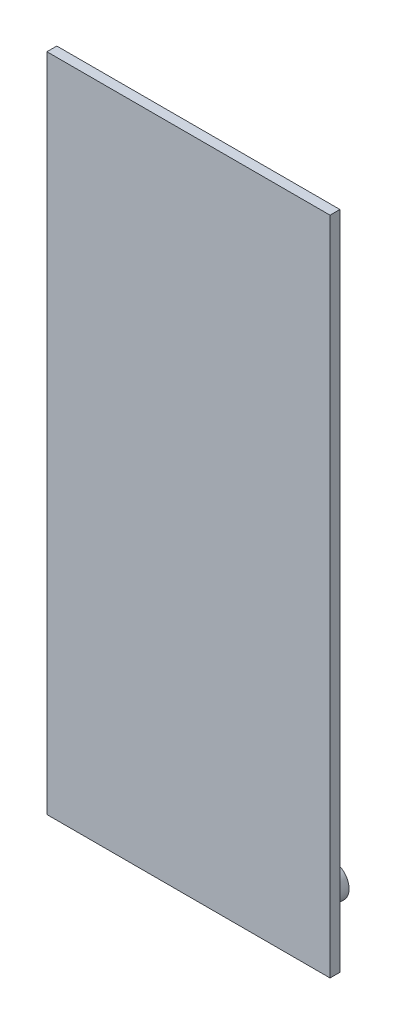
ISO-10303-21;
HEADER;
FILE_DESCRIPTION(('STEP AP214'),'2;1');
FILE_NAME('part.step','',(''),(''),'','','');
FILE_SCHEMA(('AUTOMOTIVE_DESIGN { 1 0 10303 214 1 1 1 1 }'));
ENDSEC;
DATA;
#1=APPLICATION_CONTEXT('core data for automotive mechanical design processes');
#2=APPLICATION_PROTOCOL_DEFINITION('international standard','automotive_design',2000,#1);
#3=PRODUCT_CONTEXT('',#1,'mechanical');
#4=PRODUCT('Part','Part','',(#3));
#5=PRODUCT_RELATED_PRODUCT_CATEGORY('part','',(#4));
#6=PRODUCT_DEFINITION_FORMATION('','',#4);
#7=PRODUCT_DEFINITION_CONTEXT('part definition',#1,'design');
#8=PRODUCT_DEFINITION('design','',#6,#7);
#9=PRODUCT_DEFINITION_SHAPE('','',#8);
#10=(LENGTH_UNIT() NAMED_UNIT(*) SI_UNIT(.MILLI.,.METRE.));
#11=(NAMED_UNIT(*) PLANE_ANGLE_UNIT() SI_UNIT($,.RADIAN.));
#12=(NAMED_UNIT(*) SI_UNIT($,.STERADIAN.) SOLID_ANGLE_UNIT());
#13=UNCERTAINTY_MEASURE_WITH_UNIT(LENGTH_MEASURE(1.E-05),#10,'distance_accuracy_value','');
#14=(GEOMETRIC_REPRESENTATION_CONTEXT(3) GLOBAL_UNCERTAINTY_ASSIGNED_CONTEXT((#13)) GLOBAL_UNIT_ASSIGNED_CONTEXT((#10,
#11,#12)) REPRESENTATION_CONTEXT('',''));
#15=CARTESIAN_POINT('',(0.,0.,0.));
#16=DIRECTION('',(0.,0.,1.));
#17=DIRECTION('',(1.,0.,0.));
#18=AXIS2_PLACEMENT_3D('',#15,#16,#17);
#19=CARTESIAN_POINT('',(55.4999992698431,53.,96.2149999552965));
#20=DIRECTION('',(0.,1.,0.));
#21=DIRECTION('',(1.,0.,0.));
#22=AXIS2_PLACEMENT_3D('',#19,#20,#21);
#23=PLANE('',#22);
#24=DIRECTION('',(1.,0.,0.));
#25=VECTOR('',#24,1.);
#26=CARTESIAN_POINT('',(32.9999992698431,53.,95.4299999552965));
#27=LINE('',#26,#25);
#28=CARTESIAN_POINT('',(32.9999992698431,53.,95.4299999552965));
#29=VERTEX_POINT('',#28);
#30=CARTESIAN_POINT('',(77.9999992698431,53.,95.4299999552965));
#31=VERTEX_POINT('',#30);
#32=EDGE_CURVE('E11',#29,#31,#27,.T.);
#33=ORIENTED_EDGE('',*,*,#32,.T.);
#34=DIRECTION('',(0.,0.,1.));
#35=VECTOR('',#34,1.);
#36=CARTESIAN_POINT('',(77.9999992698431,53.,95.4299999552965));
#37=LINE('',#36,#35);
#38=CARTESIAN_POINT('',(77.9999992698431,53.,96.9999999552965));
#39=VERTEX_POINT('',#38);
#40=EDGE_CURVE('E20',#31,#39,#37,.T.);
#41=ORIENTED_EDGE('',*,*,#40,.T.);
#42=DIRECTION('',(-1.,0.,0.));
#43=VECTOR('',#42,1.);
#44=CARTESIAN_POINT('',(77.9999992698431,53.,96.9999999552965));
#45=LINE('',#44,#43);
#46=CARTESIAN_POINT('',(32.9999992698431,53.,96.9999999552965));
#47=VERTEX_POINT('',#46);
#48=EDGE_CURVE('E95',#39,#47,#45,.T.);
#49=ORIENTED_EDGE('',*,*,#48,.T.);
#50=DIRECTION('',(0.,0.,-1.));
#51=VECTOR('',#50,1.);
#52=CARTESIAN_POINT('',(32.9999992698431,53.,96.9999999552965));
#53=LINE('',#52,#51);
#54=EDGE_CURVE('E130',#47,#29,#53,.T.);
#55=ORIENTED_EDGE('',*,*,#54,.T.);
#56=EDGE_LOOP('',(#33,#41,#49,#55));
#57=FACE_BOUND('',#56,.T.);
#58=ADVANCED_FACE('F17',(#57),#23,.F.);
#59=CARTESIAN_POINT('',(77.9999992698431,53.,95.4299999552965));
#60=DIRECTION('',(0.,0.,-1.));
#61=DIRECTION('',(0.,-1.,0.));
#62=AXIS2_PLACEMENT_3D('',#59,#60,#61);
#63=PLANE('',#62);
#64=CARTESIAN_POINT('',(73.0834949574164,61.5005702442213,95.4299999552965));
#65=DIRECTION('',(0.,0.,1.));
#66=DIRECTION('',(-1.,0.,0.));
#67=AXIS2_PLACEMENT_3D('',#64,#65,#66);
#68=CIRCLE('',#67,2.667);
#69=CARTESIAN_POINT('',(75.7504949574164,61.5005702442213,95.4299999552965));
#70=VERTEX_POINT('',#69);
#71=EDGE_CURVE('E121',#70,#70,#68,.T.);
#72=ORIENTED_EDGE('',*,*,#71,.T.);
#73=EDGE_LOOP('',(#72));
#74=FACE_BOUND('',#73,.T.);
#75=ORIENTED_EDGE('',*,*,#32,.F.);
#76=DIRECTION('',(0.,1.,0.));
#77=VECTOR('',#76,1.);
#78=CARTESIAN_POINT('',(32.9999992698431,53.,95.4299999552965));
#79=LINE('',#78,#77);
#80=CARTESIAN_POINT('',(32.9999992698431,158.,95.4299999552965));
#81=VERTEX_POINT('',#80);
#82=EDGE_CURVE('E27',#29,#81,#79,.T.);
#83=ORIENTED_EDGE('',*,*,#82,.T.);
#84=DIRECTION('',(-1.,0.,0.));
#85=VECTOR('',#84,1.);
#86=CARTESIAN_POINT('',(32.9999992698431,158.,95.4299999552965));
#87=LINE('',#86,#85);
#88=CARTESIAN_POINT('',(77.9999992698431,158.,95.4299999552965));
#89=VERTEX_POINT('',#88);
#90=EDGE_CURVE('E114',#89,#81,#87,.T.);
#91=ORIENTED_EDGE('',*,*,#90,.F.);
#92=DIRECTION('',(0.,1.,0.));
#93=VECTOR('',#92,1.);
#94=CARTESIAN_POINT('',(77.9999992698431,53.,95.4299999552965));
#95=LINE('',#94,#93);
#96=EDGE_CURVE('E53',#31,#89,#95,.T.);
#97=ORIENTED_EDGE('',*,*,#96,.F.);
#98=EDGE_LOOP('',(#75,#83,#91,#97));
#99=FACE_BOUND('',#98,.T.);
#100=ADVANCED_FACE('F148',(#74,#99),#63,.T.);
#101=CARTESIAN_POINT('',(32.9999992698431,53.,95.4299999552965));
#102=DIRECTION('',(-1.,0.,0.));
#103=DIRECTION('',(0.,0.,1.));
#104=AXIS2_PLACEMENT_3D('',#101,#102,#103);
#105=PLANE('',#104);
#106=ORIENTED_EDGE('',*,*,#54,.F.);
#107=DIRECTION('',(0.,1.,0.));
#108=VECTOR('',#107,1.);
#109=CARTESIAN_POINT('',(32.9999992698431,53.,96.9999999552965));
#110=LINE('',#109,#108);
#111=CARTESIAN_POINT('',(32.9999992698431,158.,96.9999999552965));
#112=VERTEX_POINT('',#111);
#113=EDGE_CURVE('E124',#47,#112,#110,.T.);
#114=ORIENTED_EDGE('',*,*,#113,.T.);
#115=DIRECTION('',(0.,0.,1.));
#116=VECTOR('',#115,1.);
#117=CARTESIAN_POINT('',(32.9999992698431,158.,96.9999999552965));
#118=LINE('',#117,#116);
#119=EDGE_CURVE('E107',#81,#112,#118,.T.);
#120=ORIENTED_EDGE('',*,*,#119,.F.);
#121=ORIENTED_EDGE('',*,*,#82,.F.);
#122=EDGE_LOOP('',(#106,#114,#120,#121));
#123=FACE_BOUND('',#122,.T.);
#124=ADVANCED_FACE('F150',(#123),#105,.T.);
#125=CARTESIAN_POINT('',(32.9999992698431,53.,96.9999999552965));
#126=DIRECTION('',(0.,0.,1.));
#127=DIRECTION('',(1.,0.,0.));
#128=AXIS2_PLACEMENT_3D('',#125,#126,#127);
#129=PLANE('',#128);
#130=ORIENTED_EDGE('',*,*,#48,.F.);
#131=DIRECTION('',(0.,1.,0.));
#132=VECTOR('',#131,1.);
#133=CARTESIAN_POINT('',(77.9999992698431,53.,96.9999999552965));
#134=LINE('',#133,#132);
#135=CARTESIAN_POINT('',(77.9999992698431,158.,96.9999999552965));
#136=VERTEX_POINT('',#135);
#137=EDGE_CURVE('E88',#39,#136,#134,.T.);
#138=ORIENTED_EDGE('',*,*,#137,.T.);
#139=DIRECTION('',(1.,0.,0.));
#140=VECTOR('',#139,1.);
#141=CARTESIAN_POINT('',(77.9999992698431,158.,96.9999999552965));
#142=LINE('',#141,#140);
#143=EDGE_CURVE('E92',#112,#136,#142,.T.);
#144=ORIENTED_EDGE('',*,*,#143,.F.);
#145=ORIENTED_EDGE('',*,*,#113,.F.);
#146=EDGE_LOOP('',(#130,#138,#144,#145));
#147=FACE_BOUND('',#146,.T.);
#148=ADVANCED_FACE('F89',(#147),#129,.T.);
#149=CARTESIAN_POINT('',(77.9999992698431,53.,96.9999999552965));
#150=DIRECTION('',(1.,0.,0.));
#151=DIRECTION('',(0.,0.,1.));
#152=AXIS2_PLACEMENT_3D('',#149,#150,#151);
#153=PLANE('',#152);
#154=ORIENTED_EDGE('',*,*,#40,.F.);
#155=ORIENTED_EDGE('',*,*,#96,.T.);
#156=DIRECTION('',(0.,0.,-1.));
#157=VECTOR('',#156,1.);
#158=CARTESIAN_POINT('',(77.9999992698431,158.,95.4299999552965));
#159=LINE('',#158,#157);
#160=EDGE_CURVE('E99',#136,#89,#159,.T.);
#161=ORIENTED_EDGE('',*,*,#160,.F.);
#162=ORIENTED_EDGE('',*,*,#137,.F.);
#163=EDGE_LOOP('',(#154,#155,#161,#162));
#164=FACE_BOUND('',#163,.T.);
#165=ADVANCED_FACE('F100',(#164),#153,.T.);
#166=CARTESIAN_POINT('',(73.0834949574164,61.5005702442213,91.722));
#167=DIRECTION('',(0.,0.,-1.));
#168=DIRECTION('',(0.,-1.,0.));
#169=AXIS2_PLACEMENT_3D('',#166,#167,#168);
#170=PLANE('',#169);
#171=CARTESIAN_POINT('',(73.0834949574164,61.5005702442213,91.722));
#172=DIRECTION('',(0.,0.,-1.));
#173=DIRECTION('',(-1.,0.,0.));
#174=AXIS2_PLACEMENT_3D('',#171,#172,#173);
#175=CIRCLE('',#174,2.667);
#176=CARTESIAN_POINT('',(75.7504949574164,61.5005702442213,91.722));
#177=VERTEX_POINT('',#176);
#178=EDGE_CURVE('E104',#177,#177,#175,.T.);
#179=ORIENTED_EDGE('',*,*,#178,.T.);
#180=EDGE_LOOP('',(#179));
#181=FACE_BOUND('',#180,.T.);
#182=ADVANCED_FACE('F145',(#181),#170,.T.);
#183=CARTESIAN_POINT('',(73.0834949574164,61.5005702442213,95.43));
#184=DIRECTION('',(0.,0.,-1.));
#185=DIRECTION('',(-1.,0.,0.));
#186=AXIS2_PLACEMENT_3D('',#183,#184,#185);
#187=CYLINDRICAL_SURFACE('',#186,2.667);
#188=ORIENTED_EDGE('',*,*,#178,.F.);
#189=DIRECTION('',(0.,0.,1.));
#190=VECTOR('',#189,1.);
#191=CARTESIAN_POINT('',(75.7504949574164,61.5005702442213,95.43));
#192=LINE('',#191,#190);
#193=EDGE_CURVE('E80',#177,#70,#192,.T.);
#194=ORIENTED_EDGE('',*,*,#193,.T.);
#195=ORIENTED_EDGE('',*,*,#71,.F.);
#196=ORIENTED_EDGE('',*,*,#193,.F.);
#197=EDGE_LOOP('',(#188,#194,#195,#196));
#198=FACE_BOUND('',#197,.T.);
#199=ADVANCED_FACE('F146',(#198),#187,.T.);
#200=CARTESIAN_POINT('',(55.4999992698431,158.,96.2149999552965));
#201=DIRECTION('',(0.,1.,0.));
#202=DIRECTION('',(1.,0.,0.));
#203=AXIS2_PLACEMENT_3D('',#200,#201,#202);
#204=PLANE('',#203);
#205=ORIENTED_EDGE('',*,*,#90,.T.);
#206=ORIENTED_EDGE('',*,*,#119,.T.);
#207=ORIENTED_EDGE('',*,*,#143,.T.);
#208=ORIENTED_EDGE('',*,*,#160,.T.);
#209=EDGE_LOOP('',(#205,#206,#207,#208));
#210=FACE_BOUND('',#209,.T.);
#211=ADVANCED_FACE('F106',(#210),#204,.T.);
#212=CLOSED_SHELL('',(#58,#100,#124,#148,#165,#182,#199,#211));
#213=MANIFOLD_SOLID_BREP('B1',#212);
#214=ADVANCED_BREP_SHAPE_REPRESENTATION('',(#18,#213),#14);
#215=SHAPE_DEFINITION_REPRESENTATION(#9,#214);
ENDSEC;
END-ISO-10303-21;
